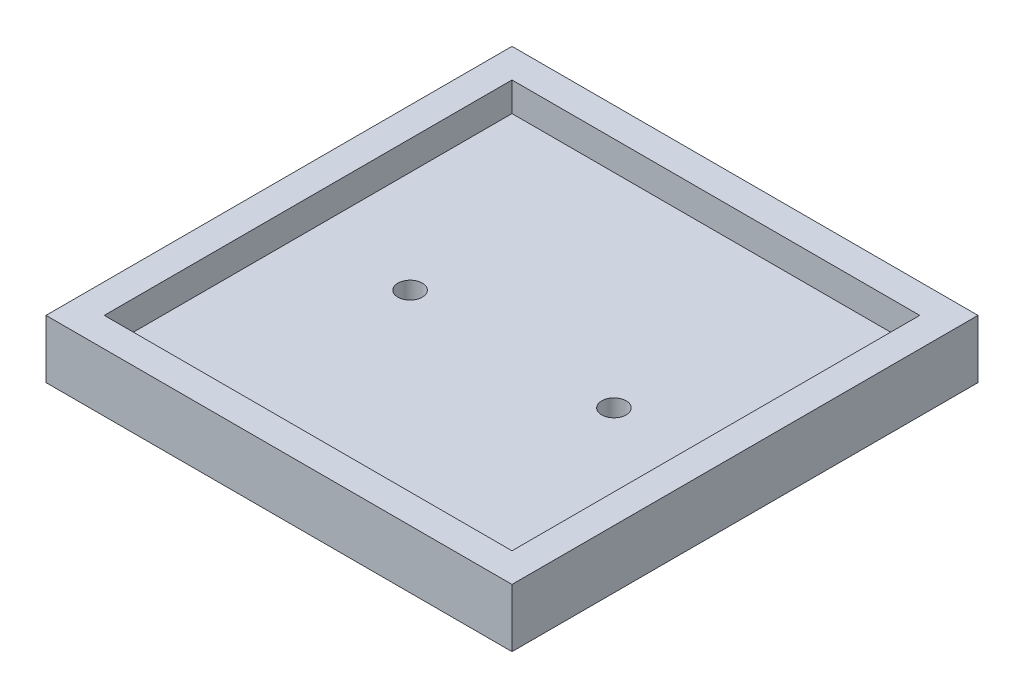
ISO-10303-21;
HEADER;
FILE_DESCRIPTION(('STEP AP214'),'2;1');
FILE_NAME('part.step','',(''),(''),'','','');
FILE_SCHEMA(('AUTOMOTIVE_DESIGN { 1 0 10303 214 1 1 1 1 }'));
ENDSEC;
DATA;
#1=APPLICATION_CONTEXT('core data for automotive mechanical design processes');
#2=APPLICATION_PROTOCOL_DEFINITION('international standard','automotive_design',2000,#1);
#3=PRODUCT_CONTEXT('',#1,'mechanical');
#4=PRODUCT('Part','Part','',(#3));
#5=PRODUCT_RELATED_PRODUCT_CATEGORY('part','',(#4));
#6=PRODUCT_DEFINITION_FORMATION('','',#4);
#7=PRODUCT_DEFINITION_CONTEXT('part definition',#1,'design');
#8=PRODUCT_DEFINITION('design','',#6,#7);
#9=PRODUCT_DEFINITION_SHAPE('','',#8);
#10=(LENGTH_UNIT() NAMED_UNIT(*) SI_UNIT(.MILLI.,.METRE.));
#11=(NAMED_UNIT(*) PLANE_ANGLE_UNIT() SI_UNIT($,.RADIAN.));
#12=(NAMED_UNIT(*) SI_UNIT($,.STERADIAN.) SOLID_ANGLE_UNIT());
#13=UNCERTAINTY_MEASURE_WITH_UNIT(LENGTH_MEASURE(1.E-05),#10,'distance_accuracy_value','');
#14=(GEOMETRIC_REPRESENTATION_CONTEXT(3) GLOBAL_UNCERTAINTY_ASSIGNED_CONTEXT((#13)) GLOBAL_UNIT_ASSIGNED_CONTEXT((#10,
#11,#12)) REPRESENTATION_CONTEXT('',''));
#15=CARTESIAN_POINT('',(0.,0.,0.));
#16=DIRECTION('',(0.,0.,1.));
#17=DIRECTION('',(1.,0.,0.));
#18=AXIS2_PLACEMENT_3D('',#15,#16,#17);
#19=CARTESIAN_POINT('',(0.,5.,0.));
#20=DIRECTION('',(1.,0.,0.));
#21=DIRECTION('',(0.,0.,-1.));
#22=AXIS2_PLACEMENT_3D('',#19,#20,#21);
#23=PLANE('',#22);
#24=DIRECTION('',(0.,0.,1.));
#25=VECTOR('',#24,1.);
#26=CARTESIAN_POINT('',(0.,0.,0.));
#27=LINE('',#26,#25);
#28=CARTESIAN_POINT('',(0.,0.,0.));
#29=VERTEX_POINT('',#28);
#30=CARTESIAN_POINT('',(0.,0.,80.));
#31=VERTEX_POINT('',#30);
#32=EDGE_CURVE('E169',#29,#31,#27,.T.);
#33=ORIENTED_EDGE('',*,*,#32,.T.);
#34=DIRECTION('',(0.,-1.,0.));
#35=VECTOR('',#34,1.);
#36=CARTESIAN_POINT('',(0.,5.,80.));
#37=LINE('',#36,#35);
#38=CARTESIAN_POINT('',(0.,10.,80.));
#39=VERTEX_POINT('',#38);
#40=EDGE_CURVE('E11',#39,#31,#37,.T.);
#41=ORIENTED_EDGE('',*,*,#40,.F.);
#42=DIRECTION('',(0.,0.,1.));
#43=VECTOR('',#42,1.);
#44=CARTESIAN_POINT('',(0.,10.,0.));
#45=LINE('',#44,#43);
#46=CARTESIAN_POINT('',(0.,10.,0.));
#47=VERTEX_POINT('',#46);
#48=EDGE_CURVE('E120',#47,#39,#45,.T.);
#49=ORIENTED_EDGE('',*,*,#48,.F.);
#50=DIRECTION('',(0.,-1.,0.));
#51=VECTOR('',#50,1.);
#52=CARTESIAN_POINT('',(0.,5.,0.));
#53=LINE('',#52,#51);
#54=EDGE_CURVE('E182',#47,#29,#53,.T.);
#55=ORIENTED_EDGE('',*,*,#54,.T.);
#56=EDGE_LOOP('',(#33,#41,#49,#55));
#57=FACE_BOUND('',#56,.T.);
#58=ADVANCED_FACE('F39',(#57),#23,.F.);
#59=CARTESIAN_POINT('',(0.,5.,80.));
#60=DIRECTION('',(0.,0.,-1.));
#61=DIRECTION('',(-1.,0.,0.));
#62=AXIS2_PLACEMENT_3D('',#59,#60,#61);
#63=PLANE('',#62);
#64=DIRECTION('',(1.,0.,0.));
#65=VECTOR('',#64,1.);
#66=CARTESIAN_POINT('',(0.,0.,80.));
#67=LINE('',#66,#65);
#68=CARTESIAN_POINT('',(80.,0.,80.));
#69=VERTEX_POINT('',#68);
#70=EDGE_CURVE('E173',#31,#69,#67,.T.);
#71=ORIENTED_EDGE('',*,*,#70,.T.);
#72=DIRECTION('',(0.,-1.,0.));
#73=VECTOR('',#72,1.);
#74=CARTESIAN_POINT('',(80.,5.,80.));
#75=LINE('',#74,#73);
#76=CARTESIAN_POINT('',(80.,10.,80.));
#77=VERTEX_POINT('',#76);
#78=EDGE_CURVE('E47',#77,#69,#75,.T.);
#79=ORIENTED_EDGE('',*,*,#78,.F.);
#80=DIRECTION('',(1.,0.,0.));
#81=VECTOR('',#80,1.);
#82=CARTESIAN_POINT('',(0.,10.,80.));
#83=LINE('',#82,#81);
#84=EDGE_CURVE('E157',#39,#77,#83,.T.);
#85=ORIENTED_EDGE('',*,*,#84,.F.);
#86=ORIENTED_EDGE('',*,*,#40,.T.);
#87=EDGE_LOOP('',(#71,#79,#85,#86));
#88=FACE_BOUND('',#87,.T.);
#89=ADVANCED_FACE('F207',(#88),#63,.F.);
#90=CARTESIAN_POINT('',(80.,5.,0.));
#91=DIRECTION('',(-1.,0.,0.));
#92=DIRECTION('',(0.,0.,1.));
#93=AXIS2_PLACEMENT_3D('',#90,#91,#92);
#94=PLANE('',#93);
#95=DIRECTION('',(0.,0.,-1.));
#96=VECTOR('',#95,1.);
#97=CARTESIAN_POINT('',(80.,0.,0.));
#98=LINE('',#97,#96);
#99=CARTESIAN_POINT('',(80.,0.,0.));
#100=VERTEX_POINT('',#99);
#101=EDGE_CURVE('E176',#69,#100,#98,.T.);
#102=ORIENTED_EDGE('',*,*,#101,.T.);
#103=DIRECTION('',(0.,-1.,0.));
#104=VECTOR('',#103,1.);
#105=CARTESIAN_POINT('',(80.,5.,0.));
#106=LINE('',#105,#104);
#107=CARTESIAN_POINT('',(80.,10.,0.));
#108=VERTEX_POINT('',#107);
#109=EDGE_CURVE('E186',#108,#100,#106,.T.);
#110=ORIENTED_EDGE('',*,*,#109,.F.);
#111=DIRECTION('',(0.,0.,-1.));
#112=VECTOR('',#111,1.);
#113=CARTESIAN_POINT('',(80.,10.,0.));
#114=LINE('',#113,#112);
#115=EDGE_CURVE('E161',#77,#108,#114,.T.);
#116=ORIENTED_EDGE('',*,*,#115,.F.);
#117=ORIENTED_EDGE('',*,*,#78,.T.);
#118=EDGE_LOOP('',(#102,#110,#116,#117));
#119=FACE_BOUND('',#118,.T.);
#120=ADVANCED_FACE('F194',(#119),#94,.F.);
#121=CARTESIAN_POINT('',(0.,5.,0.));
#122=DIRECTION('',(0.,0.,1.));
#123=DIRECTION('',(1.,0.,0.));
#124=AXIS2_PLACEMENT_3D('',#121,#122,#123);
#125=PLANE('',#124);
#126=DIRECTION('',(-1.,0.,0.));
#127=VECTOR('',#126,1.);
#128=CARTESIAN_POINT('',(0.,0.,0.));
#129=LINE('',#128,#127);
#130=EDGE_CURVE('E179',#100,#29,#129,.T.);
#131=ORIENTED_EDGE('',*,*,#130,.T.);
#132=ORIENTED_EDGE('',*,*,#54,.F.);
#133=DIRECTION('',(-1.,0.,0.));
#134=VECTOR('',#133,1.);
#135=CARTESIAN_POINT('',(0.,10.,0.));
#136=LINE('',#135,#134);
#137=EDGE_CURVE('E165',#108,#47,#136,.T.);
#138=ORIENTED_EDGE('',*,*,#137,.F.);
#139=ORIENTED_EDGE('',*,*,#109,.T.);
#140=EDGE_LOOP('',(#131,#132,#138,#139));
#141=FACE_BOUND('',#140,.T.);
#142=ADVANCED_FACE('F202',(#141),#125,.F.);
#143=CARTESIAN_POINT('',(0.,0.,0.));
#144=DIRECTION('',(0.,1.,0.));
#145=DIRECTION('',(0.,0.,1.));
#146=AXIS2_PLACEMENT_3D('',#143,#144,#145);
#147=PLANE('',#146);
#148=CARTESIAN_POINT('',(22.5,0.,40.));
#149=DIRECTION('',(0.,1.,0.));
#150=DIRECTION('',(0.,0.,1.));
#151=AXIS2_PLACEMENT_3D('',#148,#149,#150);
#152=CIRCLE('',#151,2.1);
#153=CARTESIAN_POINT('',(22.5,0.,42.1));
#154=VERTEX_POINT('',#153);
#155=EDGE_CURVE('E138',#154,#154,#152,.F.);
#156=ORIENTED_EDGE('',*,*,#155,.F.);
#157=EDGE_LOOP('',(#156));
#158=FACE_BOUND('',#157,.T.);
#159=CARTESIAN_POINT('',(57.5,0.,40.));
#160=DIRECTION('',(0.,1.,0.));
#161=DIRECTION('',(0.,0.,1.));
#162=AXIS2_PLACEMENT_3D('',#159,#160,#161);
#163=CIRCLE('',#162,2.1);
#164=CARTESIAN_POINT('',(57.5,0.,42.1));
#165=VERTEX_POINT('',#164);
#166=EDGE_CURVE('E256',#165,#165,#163,.F.);
#167=ORIENTED_EDGE('',*,*,#166,.F.);
#168=EDGE_LOOP('',(#167));
#169=FACE_BOUND('',#168,.T.);
#170=ORIENTED_EDGE('',*,*,#32,.F.);
#171=ORIENTED_EDGE('',*,*,#130,.F.);
#172=ORIENTED_EDGE('',*,*,#101,.F.);
#173=ORIENTED_EDGE('',*,*,#70,.F.);
#174=EDGE_LOOP('',(#170,#171,#172,#173));
#175=FACE_BOUND('',#174,.T.);
#176=ADVANCED_FACE('F200',(#158,#169,#175),#147,.F.);
#177=CARTESIAN_POINT('',(0.,10.,0.));
#178=DIRECTION('',(0.,1.,0.));
#179=DIRECTION('',(0.,0.,1.));
#180=AXIS2_PLACEMENT_3D('',#177,#178,#179);
#181=PLANE('',#180);
#182=ORIENTED_EDGE('',*,*,#48,.T.);
#183=ORIENTED_EDGE('',*,*,#84,.T.);
#184=ORIENTED_EDGE('',*,*,#115,.T.);
#185=ORIENTED_EDGE('',*,*,#137,.T.);
#186=EDGE_LOOP('',(#182,#183,#184,#185));
#187=FACE_BOUND('',#186,.T.);
#188=DIRECTION('',(1.,0.,0.));
#189=VECTOR('',#188,1.);
#190=CARTESIAN_POINT('',(5.00000000000001,10.,75.));
#191=LINE('',#190,#189);
#192=CARTESIAN_POINT('',(5.00000000000001,10.,75.));
#193=VERTEX_POINT('',#192);
#194=CARTESIAN_POINT('',(75.,10.,75.));
#195=VERTEX_POINT('',#194);
#196=EDGE_CURVE('E113',#193,#195,#191,.T.);
#197=ORIENTED_EDGE('',*,*,#196,.F.);
#198=DIRECTION('',(0.,0.,1.));
#199=VECTOR('',#198,1.);
#200=CARTESIAN_POINT('',(5.,10.,5.));
#201=LINE('',#200,#199);
#202=CARTESIAN_POINT('',(5.,10.,5.));
#203=VERTEX_POINT('',#202);
#204=EDGE_CURVE('E103',#203,#193,#201,.T.);
#205=ORIENTED_EDGE('',*,*,#204,.F.);
#206=DIRECTION('',(-1.,0.,0.));
#207=VECTOR('',#206,1.);
#208=CARTESIAN_POINT('',(5.,10.,5.));
#209=LINE('',#208,#207);
#210=CARTESIAN_POINT('',(75.,10.,5.));
#211=VERTEX_POINT('',#210);
#212=EDGE_CURVE('E130',#211,#203,#209,.T.);
#213=ORIENTED_EDGE('',*,*,#212,.F.);
#214=DIRECTION('',(0.,0.,-1.));
#215=VECTOR('',#214,1.);
#216=CARTESIAN_POINT('',(75.,10.,5.));
#217=LINE('',#216,#215);
#218=EDGE_CURVE('E126',#195,#211,#217,.T.);
#219=ORIENTED_EDGE('',*,*,#218,.F.);
#220=EDGE_LOOP('',(#197,#205,#213,#219));
#221=FACE_BOUND('',#220,.T.);
#222=ADVANCED_FACE('F124',(#187,#221),#181,.T.);
#223=CARTESIAN_POINT('',(5.,10.,5.));
#224=DIRECTION('',(1.,0.,0.));
#225=DIRECTION('',(0.,0.,-1.));
#226=AXIS2_PLACEMENT_3D('',#223,#224,#225);
#227=PLANE('',#226);
#228=DIRECTION('',(0.,0.,1.));
#229=VECTOR('',#228,1.);
#230=CARTESIAN_POINT('',(5.,5.,5.));
#231=LINE('',#230,#229);
#232=CARTESIAN_POINT('',(5.,5.,5.));
#233=VERTEX_POINT('',#232);
#234=CARTESIAN_POINT('',(5.00000000000001,5.,75.));
#235=VERTEX_POINT('',#234);
#236=EDGE_CURVE('E54',#233,#235,#231,.T.);
#237=ORIENTED_EDGE('',*,*,#236,.F.);
#238=DIRECTION('',(0.,-1.,0.));
#239=VECTOR('',#238,1.);
#240=CARTESIAN_POINT('',(5.,10.,5.));
#241=LINE('',#240,#239);
#242=EDGE_CURVE('E108',#203,#233,#241,.T.);
#243=ORIENTED_EDGE('',*,*,#242,.F.);
#244=ORIENTED_EDGE('',*,*,#204,.T.);
#245=DIRECTION('',(0.,-1.,0.));
#246=VECTOR('',#245,1.);
#247=CARTESIAN_POINT('',(5.00000000000001,10.,75.));
#248=LINE('',#247,#246);
#249=EDGE_CURVE('E106',#193,#235,#248,.T.);
#250=ORIENTED_EDGE('',*,*,#249,.T.);
#251=EDGE_LOOP('',(#237,#243,#244,#250));
#252=FACE_BOUND('',#251,.T.);
#253=ADVANCED_FACE('F105',(#252),#227,.T.);
#254=CARTESIAN_POINT('',(5.00000000000001,10.,75.));
#255=DIRECTION('',(0.,0.,-1.));
#256=DIRECTION('',(-1.,0.,0.));
#257=AXIS2_PLACEMENT_3D('',#254,#255,#256);
#258=PLANE('',#257);
#259=DIRECTION('',(1.,0.,0.));
#260=VECTOR('',#259,1.);
#261=CARTESIAN_POINT('',(5.00000000000001,5.,75.));
#262=LINE('',#261,#260);
#263=CARTESIAN_POINT('',(75.,5.,75.));
#264=VERTEX_POINT('',#263);
#265=EDGE_CURVE('E58',#235,#264,#262,.T.);
#266=ORIENTED_EDGE('',*,*,#265,.F.);
#267=ORIENTED_EDGE('',*,*,#249,.F.);
#268=ORIENTED_EDGE('',*,*,#196,.T.);
#269=DIRECTION('',(0.,-1.,0.));
#270=VECTOR('',#269,1.);
#271=CARTESIAN_POINT('',(75.,10.,75.));
#272=LINE('',#271,#270);
#273=EDGE_CURVE('E121',#195,#264,#272,.T.);
#274=ORIENTED_EDGE('',*,*,#273,.T.);
#275=EDGE_LOOP('',(#266,#267,#268,#274));
#276=FACE_BOUND('',#275,.T.);
#277=ADVANCED_FACE('F117',(#276),#258,.T.);
#278=CARTESIAN_POINT('',(75.,10.,5.));
#279=DIRECTION('',(-1.,0.,0.));
#280=DIRECTION('',(0.,0.,1.));
#281=AXIS2_PLACEMENT_3D('',#278,#279,#280);
#282=PLANE('',#281);
#283=DIRECTION('',(0.,0.,-1.));
#284=VECTOR('',#283,1.);
#285=CARTESIAN_POINT('',(75.,5.,5.));
#286=LINE('',#285,#284);
#287=CARTESIAN_POINT('',(75.,5.,5.));
#288=VERTEX_POINT('',#287);
#289=EDGE_CURVE('E141',#264,#288,#286,.T.);
#290=ORIENTED_EDGE('',*,*,#289,.F.);
#291=ORIENTED_EDGE('',*,*,#273,.F.);
#292=ORIENTED_EDGE('',*,*,#218,.T.);
#293=DIRECTION('',(0.,-1.,0.));
#294=VECTOR('',#293,1.);
#295=CARTESIAN_POINT('',(75.,10.,5.));
#296=LINE('',#295,#294);
#297=EDGE_CURVE('E148',#211,#288,#296,.T.);
#298=ORIENTED_EDGE('',*,*,#297,.T.);
#299=EDGE_LOOP('',(#290,#291,#292,#298));
#300=FACE_BOUND('',#299,.T.);
#301=ADVANCED_FACE('F232',(#300),#282,.T.);
#302=CARTESIAN_POINT('',(5.,10.,5.));
#303=DIRECTION('',(0.,0.,1.));
#304=DIRECTION('',(1.,0.,0.));
#305=AXIS2_PLACEMENT_3D('',#302,#303,#304);
#306=PLANE('',#305);
#307=DIRECTION('',(-1.,0.,0.));
#308=VECTOR('',#307,1.);
#309=CARTESIAN_POINT('',(5.,5.,5.));
#310=LINE('',#309,#308);
#311=EDGE_CURVE('E114',#288,#233,#310,.T.);
#312=ORIENTED_EDGE('',*,*,#311,.F.);
#313=ORIENTED_EDGE('',*,*,#297,.F.);
#314=ORIENTED_EDGE('',*,*,#212,.T.);
#315=ORIENTED_EDGE('',*,*,#242,.T.);
#316=EDGE_LOOP('',(#312,#313,#314,#315));
#317=FACE_BOUND('',#316,.T.);
#318=ADVANCED_FACE('F224',(#317),#306,.T.);
#319=CARTESIAN_POINT('',(0.,5.,0.));
#320=DIRECTION('',(0.,1.,0.));
#321=DIRECTION('',(0.,0.,1.));
#322=AXIS2_PLACEMENT_3D('',#319,#320,#321);
#323=PLANE('',#322);
#324=CARTESIAN_POINT('',(22.5,5.,40.));
#325=DIRECTION('',(0.,1.,0.));
#326=DIRECTION('',(0.,0.,1.));
#327=AXIS2_PLACEMENT_3D('',#324,#325,#326);
#328=CIRCLE('',#327,2.1);
#329=CARTESIAN_POINT('',(22.5,5.,42.1));
#330=VERTEX_POINT('',#329);
#331=EDGE_CURVE('E250',#330,#330,#328,.T.);
#332=ORIENTED_EDGE('',*,*,#331,.F.);
#333=EDGE_LOOP('',(#332));
#334=FACE_BOUND('',#333,.T.);
#335=CARTESIAN_POINT('',(57.5,5.,40.));
#336=DIRECTION('',(0.,1.,0.));
#337=DIRECTION('',(0.,0.,1.));
#338=AXIS2_PLACEMENT_3D('',#335,#336,#337);
#339=CIRCLE('',#338,2.1);
#340=CARTESIAN_POINT('',(57.5,5.,42.1));
#341=VERTEX_POINT('',#340);
#342=EDGE_CURVE('E259',#341,#341,#339,.T.);
#343=ORIENTED_EDGE('',*,*,#342,.F.);
#344=EDGE_LOOP('',(#343));
#345=FACE_BOUND('',#344,.T.);
#346=ORIENTED_EDGE('',*,*,#236,.T.);
#347=ORIENTED_EDGE('',*,*,#265,.T.);
#348=ORIENTED_EDGE('',*,*,#289,.T.);
#349=ORIENTED_EDGE('',*,*,#311,.T.);
#350=EDGE_LOOP('',(#346,#347,#348,#349));
#351=FACE_BOUND('',#350,.T.);
#352=ADVANCED_FACE('F220',(#334,#345,#351),#323,.T.);
#353=CARTESIAN_POINT('',(57.5,-0.00100000000000013,40.));
#354=DIRECTION('',(0.,1.,0.));
#355=DIRECTION('',(0.,0.,1.));
#356=AXIS2_PLACEMENT_3D('',#353,#354,#355);
#357=CYLINDRICAL_SURFACE('',#356,2.1);
#358=ORIENTED_EDGE('',*,*,#342,.T.);
#359=EDGE_LOOP('',(#358));
#360=FACE_BOUND('',#359,.T.);
#361=ORIENTED_EDGE('',*,*,#166,.T.);
#362=EDGE_LOOP('',(#361));
#363=FACE_BOUND('',#362,.T.);
#364=ADVANCED_FACE('F223',(#360,#363),#357,.F.);
#365=CARTESIAN_POINT('',(22.5,-0.00100000000000013,40.));
#366=DIRECTION('',(0.,1.,0.));
#367=DIRECTION('',(0.,0.,1.));
#368=AXIS2_PLACEMENT_3D('',#365,#366,#367);
#369=CYLINDRICAL_SURFACE('',#368,2.1);
#370=ORIENTED_EDGE('',*,*,#331,.T.);
#371=EDGE_LOOP('',(#370));
#372=FACE_BOUND('',#371,.T.);
#373=ORIENTED_EDGE('',*,*,#155,.T.);
#374=EDGE_LOOP('',(#373));
#375=FACE_BOUND('',#374,.T.);
#376=ADVANCED_FACE('F241',(#372,#375),#369,.F.);
#377=CLOSED_SHELL('',(#58,#89,#120,#142,#176,#222,#253,#277,#301,#318,#352,#364,#376));
#378=MANIFOLD_SOLID_BREP('B2',#377);
#379=ADVANCED_BREP_SHAPE_REPRESENTATION('',(#18,#378),#14);
#380=SHAPE_DEFINITION_REPRESENTATION(#9,#379);
ENDSEC;
END-ISO-10303-21;
